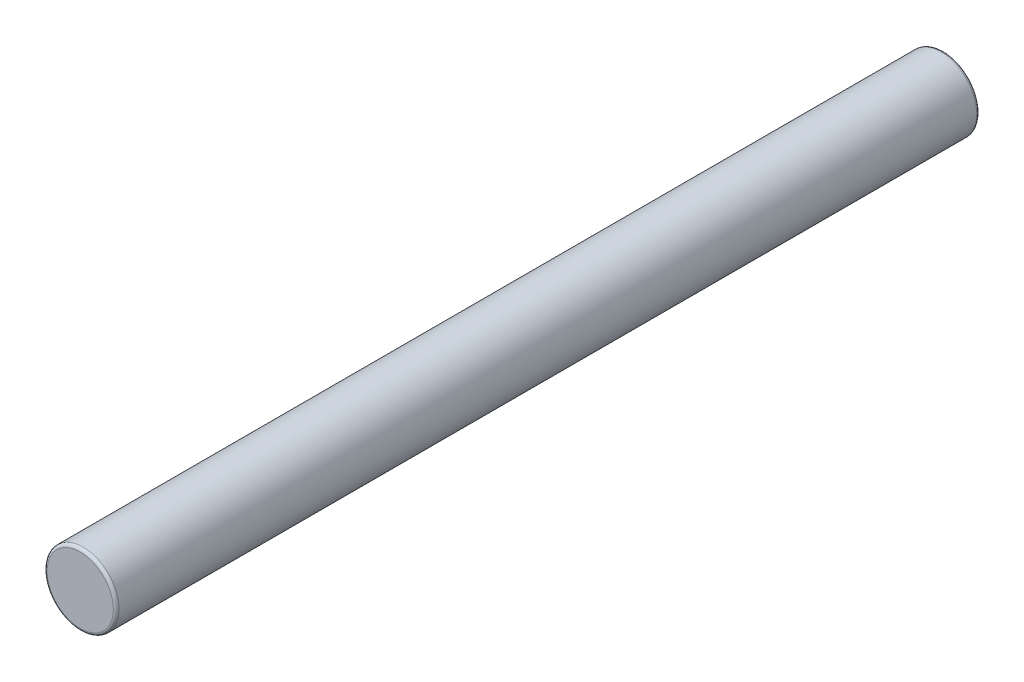
ISO-10303-21;
HEADER;
FILE_DESCRIPTION(('STEP AP214'),'2;1');
FILE_NAME('part.step','',(''),(''),'','','');
FILE_SCHEMA(('AUTOMOTIVE_DESIGN { 1 0 10303 214 1 1 1 1 }'));
ENDSEC;
DATA;
#1=APPLICATION_CONTEXT('core data for automotive mechanical design processes');
#2=APPLICATION_PROTOCOL_DEFINITION('international standard','automotive_design',2000,#1);
#3=PRODUCT_CONTEXT('',#1,'mechanical');
#4=PRODUCT('Part','Part','',(#3));
#5=PRODUCT_RELATED_PRODUCT_CATEGORY('part','',(#4));
#6=PRODUCT_DEFINITION_FORMATION('','',#4);
#7=PRODUCT_DEFINITION_CONTEXT('part definition',#1,'design');
#8=PRODUCT_DEFINITION('design','',#6,#7);
#9=PRODUCT_DEFINITION_SHAPE('','',#8);
#10=(LENGTH_UNIT() NAMED_UNIT(*) SI_UNIT(.MILLI.,.METRE.));
#11=(NAMED_UNIT(*) PLANE_ANGLE_UNIT() SI_UNIT($,.RADIAN.));
#12=(NAMED_UNIT(*) SI_UNIT($,.STERADIAN.) SOLID_ANGLE_UNIT());
#13=UNCERTAINTY_MEASURE_WITH_UNIT(LENGTH_MEASURE(1.E-05),#10,'distance_accuracy_value','');
#14=(GEOMETRIC_REPRESENTATION_CONTEXT(3) GLOBAL_UNCERTAINTY_ASSIGNED_CONTEXT((#13)) GLOBAL_UNIT_ASSIGNED_CONTEXT((#10,
#11,#12)) REPRESENTATION_CONTEXT('',''));
#15=CARTESIAN_POINT('',(0.,0.,0.));
#16=DIRECTION('',(0.,0.,1.));
#17=DIRECTION('',(1.,0.,0.));
#18=AXIS2_PLACEMENT_3D('',#15,#16,#17);
#19=CARTESIAN_POINT('',(0.,0.,60.));
#20=DIRECTION('',(0.,0.,-1.));
#21=DIRECTION('',(-1.,0.,0.));
#22=AXIS2_PLACEMENT_3D('',#19,#20,#21);
#23=CYLINDRICAL_SURFACE('',#22,2.5);
#24=CARTESIAN_POINT('',(0.,0.,0.199999999999999));
#25=DIRECTION('',(0.,0.,1.));
#26=DIRECTION('',(1.,0.,0.));
#27=AXIS2_PLACEMENT_3D('',#24,#25,#26);
#28=CIRCLE('',#27,2.5);
#29=CARTESIAN_POINT('',(2.5,0.,0.199999999999999));
#30=VERTEX_POINT('',#29);
#31=EDGE_CURVE('E44',#30,#30,#28,.T.);
#32=ORIENTED_EDGE('',*,*,#31,.T.);
#33=EDGE_LOOP('',(#32));
#34=FACE_BOUND('',#33,.T.);
#35=CARTESIAN_POINT('',(0.,0.,59.8));
#36=DIRECTION('',(0.,0.,1.));
#37=DIRECTION('',(1.,0.,0.));
#38=AXIS2_PLACEMENT_3D('',#35,#36,#37);
#39=CIRCLE('',#38,2.5);
#40=CARTESIAN_POINT('',(2.5,0.,59.8));
#41=VERTEX_POINT('',#40);
#42=EDGE_CURVE('E48',#41,#41,#39,.F.);
#43=ORIENTED_EDGE('',*,*,#42,.T.);
#44=EDGE_LOOP('',(#43));
#45=FACE_BOUND('',#44,.T.);
#46=ADVANCED_FACE('F33',(#34,#45),#23,.T.);
#47=CARTESIAN_POINT('',(0.,0.,60.));
#48=DIRECTION('',(0.,0.,1.));
#49=DIRECTION('',(1.,0.,0.));
#50=AXIS2_PLACEMENT_3D('',#47,#48,#49);
#51=PLANE('',#50);
#52=CARTESIAN_POINT('',(0.,0.,60.));
#53=DIRECTION('',(0.,0.,1.));
#54=DIRECTION('',(1.,0.,0.));
#55=AXIS2_PLACEMENT_3D('',#52,#53,#54);
#56=CIRCLE('',#55,2.3);
#57=CARTESIAN_POINT('',(2.3,0.,60.));
#58=VERTEX_POINT('',#57);
#59=EDGE_CURVE('E10',#58,#58,#56,.T.);
#60=ORIENTED_EDGE('',*,*,#59,.T.);
#61=EDGE_LOOP('',(#60));
#62=FACE_BOUND('',#61,.T.);
#63=ADVANCED_FACE('F64',(#62),#51,.T.);
#64=CARTESIAN_POINT('',(0.,0.,0.));
#65=DIRECTION('',(0.,0.,1.));
#66=DIRECTION('',(1.,0.,0.));
#67=AXIS2_PLACEMENT_3D('',#64,#65,#66);
#68=PLANE('',#67);
#69=CARTESIAN_POINT('',(0.,0.,0.));
#70=DIRECTION('',(0.,0.,1.));
#71=DIRECTION('',(1.,0.,0.));
#72=AXIS2_PLACEMENT_3D('',#69,#70,#71);
#73=CIRCLE('',#72,2.3);
#74=CARTESIAN_POINT('',(2.3,0.,0.));
#75=VERTEX_POINT('',#74);
#76=EDGE_CURVE('E40',#75,#75,#73,.F.);
#77=ORIENTED_EDGE('',*,*,#76,.T.);
#78=EDGE_LOOP('',(#77));
#79=FACE_BOUND('',#78,.T.);
#80=ADVANCED_FACE('F61',(#79),#68,.F.);
#81=CARTESIAN_POINT('',(0.,0.,0.199999999999999));
#82=DIRECTION('',(0.,0.,1.));
#83=DIRECTION('',(1.,0.,0.));
#84=AXIS2_PLACEMENT_3D('',#81,#82,#83);
#85=TOROIDAL_SURFACE('',#84,2.3,0.2);
#86=ORIENTED_EDGE('',*,*,#76,.F.);
#87=EDGE_LOOP('',(#86));
#88=FACE_BOUND('',#87,.T.);
#89=ORIENTED_EDGE('',*,*,#31,.F.);
#90=EDGE_LOOP('',(#89));
#91=FACE_BOUND('',#90,.T.);
#92=ADVANCED_FACE('F57',(#88,#91),#85,.T.);
#93=CARTESIAN_POINT('',(0.,0.,59.8));
#94=DIRECTION('',(0.,0.,1.));
#95=DIRECTION('',(1.,0.,0.));
#96=AXIS2_PLACEMENT_3D('',#93,#94,#95);
#97=TOROIDAL_SURFACE('',#96,2.3,0.2);
#98=ORIENTED_EDGE('',*,*,#42,.F.);
#99=EDGE_LOOP('',(#98));
#100=FACE_BOUND('',#99,.T.);
#101=ORIENTED_EDGE('',*,*,#59,.F.);
#102=EDGE_LOOP('',(#101));
#103=FACE_BOUND('',#102,.T.);
#104=ADVANCED_FACE('F35',(#100,#103),#97,.T.);
#105=CLOSED_SHELL('',(#46,#63,#80,#92,#104));
#106=MANIFOLD_SOLID_BREP('B2',#105);
#107=ADVANCED_BREP_SHAPE_REPRESENTATION('',(#18,#106),#14);
#108=SHAPE_DEFINITION_REPRESENTATION(#9,#107);
ENDSEC;
END-ISO-10303-21;
